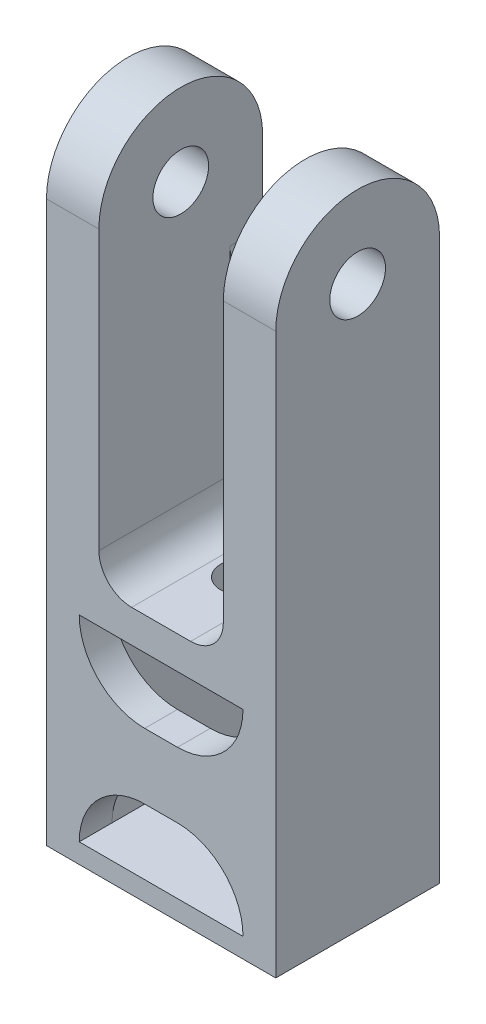
ISO-10303-21;
HEADER;
FILE_DESCRIPTION(('STEP AP214'),'2;1');
FILE_NAME('part.step','',(''),(''),'','','');
FILE_SCHEMA(('AUTOMOTIVE_DESIGN { 1 0 10303 214 1 1 1 1 }'));
ENDSEC;
DATA;
#1=APPLICATION_CONTEXT('core data for automotive mechanical design processes');
#2=APPLICATION_PROTOCOL_DEFINITION('international standard','automotive_design',2000,#1);
#3=PRODUCT_CONTEXT('',#1,'mechanical');
#4=PRODUCT('Part','Part','',(#3));
#5=PRODUCT_RELATED_PRODUCT_CATEGORY('part','',(#4));
#6=PRODUCT_DEFINITION_FORMATION('','',#4);
#7=PRODUCT_DEFINITION_CONTEXT('part definition',#1,'design');
#8=PRODUCT_DEFINITION('design','',#6,#7);
#9=PRODUCT_DEFINITION_SHAPE('','',#8);
#10=(LENGTH_UNIT() NAMED_UNIT(*) SI_UNIT(.MILLI.,.METRE.));
#11=(NAMED_UNIT(*) PLANE_ANGLE_UNIT() SI_UNIT($,.RADIAN.));
#12=(NAMED_UNIT(*) SI_UNIT($,.STERADIAN.) SOLID_ANGLE_UNIT());
#13=UNCERTAINTY_MEASURE_WITH_UNIT(LENGTH_MEASURE(1.E-05),#10,'distance_accuracy_value','');
#14=(GEOMETRIC_REPRESENTATION_CONTEXT(3) GLOBAL_UNCERTAINTY_ASSIGNED_CONTEXT((#13)) GLOBAL_UNIT_ASSIGNED_CONTEXT((#10,
#11,#12)) REPRESENTATION_CONTEXT('',''));
#15=CARTESIAN_POINT('',(0.,0.,0.));
#16=DIRECTION('',(0.,0.,1.));
#17=DIRECTION('',(1.,0.,0.));
#18=AXIS2_PLACEMENT_3D('',#15,#16,#17);
#19=CARTESIAN_POINT('',(0.,0.,20.));
#20=DIRECTION('',(0.,0.,-1.));
#21=DIRECTION('',(-1.,0.,0.));
#22=AXIS2_PLACEMENT_3D('',#19,#20,#21);
#23=PLANE('',#22);
#24=DIRECTION('',(0.,-1.,0.));
#25=VECTOR('',#24,1.);
#26=CARTESIAN_POINT('',(5.00000000000001,5.,20.));
#27=LINE('',#26,#25);
#28=CARTESIAN_POINT('',(5.00000000000001,35.,20.));
#29=VERTEX_POINT('',#28);
#30=CARTESIAN_POINT('',(5.00000000000001,5.,20.));
#31=VERTEX_POINT('',#30);
#32=EDGE_CURVE('E365',#29,#31,#27,.T.);
#33=ORIENTED_EDGE('',*,*,#32,.F.);
#34=CARTESIAN_POINT('',(15.,35.,20.));
#35=DIRECTION('',(0.,0.,-1.));
#36=DIRECTION('',(-1.,0.,0.));
#37=AXIS2_PLACEMENT_3D('',#34,#35,#36);
#38=CIRCLE('',#37,10.);
#39=CARTESIAN_POINT('',(15.,25.,20.));
#40=VERTEX_POINT('',#39);
#41=EDGE_CURVE('E265',#29,#40,#38,.F.);
#42=ORIENTED_EDGE('',*,*,#41,.T.);
#43=DIRECTION('',(1.,0.,0.));
#44=VECTOR('',#43,1.);
#45=CARTESIAN_POINT('',(0.,25.,20.));
#46=LINE('',#45,#44);
#47=CARTESIAN_POINT('',(20.,25.,20.));
#48=VERTEX_POINT('',#47);
#49=EDGE_CURVE('E354',#40,#48,#46,.T.);
#50=ORIENTED_EDGE('',*,*,#49,.T.);
#51=CARTESIAN_POINT('',(20.,35.,20.));
#52=DIRECTION('',(0.,0.,-1.));
#53=DIRECTION('',(-1.,0.,0.));
#54=AXIS2_PLACEMENT_3D('',#51,#52,#53);
#55=CIRCLE('',#54,10.);
#56=CARTESIAN_POINT('',(30.,35.,20.));
#57=VERTEX_POINT('',#56);
#58=EDGE_CURVE('E266',#48,#57,#55,.F.);
#59=ORIENTED_EDGE('',*,*,#58,.T.);
#60=DIRECTION('',(0.,1.,0.));
#61=VECTOR('',#60,1.);
#62=CARTESIAN_POINT('',(30.,5.,20.));
#63=LINE('',#62,#61);
#64=CARTESIAN_POINT('',(30.,5.,20.));
#65=VERTEX_POINT('',#64);
#66=EDGE_CURVE('E363',#65,#57,#63,.T.);
#67=ORIENTED_EDGE('',*,*,#66,.F.);
#68=CARTESIAN_POINT('',(20.,5.,20.));
#69=DIRECTION('',(0.,0.,-1.));
#70=DIRECTION('',(-1.,0.,0.));
#71=AXIS2_PLACEMENT_3D('',#68,#69,#70);
#72=CIRCLE('',#71,10.);
#73=CARTESIAN_POINT('',(20.,15.,20.));
#74=VERTEX_POINT('',#73);
#75=EDGE_CURVE('E508',#65,#74,#72,.F.);
#76=ORIENTED_EDGE('',*,*,#75,.T.);
#77=DIRECTION('',(1.,0.,0.));
#78=VECTOR('',#77,1.);
#79=CARTESIAN_POINT('',(0.,15.,20.));
#80=LINE('',#79,#78);
#81=CARTESIAN_POINT('',(15.,15.,20.));
#82=VERTEX_POINT('',#81);
#83=EDGE_CURVE('E339',#82,#74,#80,.T.);
#84=ORIENTED_EDGE('',*,*,#83,.F.);
#85=CARTESIAN_POINT('',(15.,5.,20.));
#86=DIRECTION('',(0.,0.,-1.));
#87=DIRECTION('',(-1.,0.,0.));
#88=AXIS2_PLACEMENT_3D('',#85,#86,#87);
#89=CIRCLE('',#88,10.);
#90=EDGE_CURVE('E275',#82,#31,#89,.F.);
#91=ORIENTED_EDGE('',*,*,#90,.T.);
#92=EDGE_LOOP('',(#33,#42,#50,#59,#67,#76,#84,#91));
#93=FACE_BOUND('',#92,.T.);
#94=ADVANCED_FACE('F41',(#93),#23,.T.);
#95=CARTESIAN_POINT('',(0.,0.,25.));
#96=DIRECTION('',(0.,0.,-1.));
#97=DIRECTION('',(-1.,0.,0.));
#98=AXIS2_PLACEMENT_3D('',#95,#96,#97);
#99=PLANE('',#98);
#100=DIRECTION('',(0.,-1.,0.));
#101=VECTOR('',#100,1.);
#102=CARTESIAN_POINT('',(0.,0.,25.));
#103=LINE('',#102,#101);
#104=CARTESIAN_POINT('',(0.,87.5,25.));
#105=VERTEX_POINT('',#104);
#106=CARTESIAN_POINT('',(0.,2.00000000000003,25.));
#107=VERTEX_POINT('',#106);
#108=EDGE_CURVE('E419',#105,#107,#103,.T.);
#109=ORIENTED_EDGE('',*,*,#108,.T.);
#110=DIRECTION('',(1.,0.,0.));
#111=VECTOR('',#110,1.);
#112=CARTESIAN_POINT('',(0.,2.00000000000003,25.));
#113=LINE('',#112,#111);
#114=CARTESIAN_POINT('',(35.,2.00000000000003,25.));
#115=VERTEX_POINT('',#114);
#116=EDGE_CURVE('E469',#107,#115,#113,.T.);
#117=ORIENTED_EDGE('',*,*,#116,.T.);
#118=DIRECTION('',(0.,1.,0.));
#119=VECTOR('',#118,1.);
#120=CARTESIAN_POINT('',(35.,0.,25.));
#121=LINE('',#120,#119);
#122=CARTESIAN_POINT('',(35.,87.5,25.));
#123=VERTEX_POINT('',#122);
#124=EDGE_CURVE('E422',#115,#123,#121,.T.);
#125=ORIENTED_EDGE('',*,*,#124,.T.);
#126=DIRECTION('',(-1.,0.,0.));
#127=VECTOR('',#126,1.);
#128=CARTESIAN_POINT('',(0.,87.5,25.));
#129=LINE('',#128,#127);
#130=CARTESIAN_POINT('',(27.,87.5,25.));
#131=VERTEX_POINT('',#130);
#132=EDGE_CURVE('E333',#123,#131,#129,.T.);
#133=ORIENTED_EDGE('',*,*,#132,.T.);
#134=DIRECTION('',(0.,1.,0.));
#135=VECTOR('',#134,1.);
#136=CARTESIAN_POINT('',(27.,160.,25.));
#137=LINE('',#136,#135);
#138=CARTESIAN_POINT('',(27.,45.,25.));
#139=VERTEX_POINT('',#138);
#140=EDGE_CURVE('E412',#139,#131,#137,.T.);
#141=ORIENTED_EDGE('',*,*,#140,.F.);
#142=CARTESIAN_POINT('',(22.,45.,25.));
#143=DIRECTION('',(0.,0.,-1.));
#144=DIRECTION('',(-1.,0.,0.));
#145=AXIS2_PLACEMENT_3D('',#142,#143,#144);
#146=CIRCLE('',#145,5.);
#147=CARTESIAN_POINT('',(22.,40.,25.));
#148=VERTEX_POINT('',#147);
#149=EDGE_CURVE('E496',#139,#148,#146,.T.);
#150=ORIENTED_EDGE('',*,*,#149,.T.);
#151=DIRECTION('',(1.,0.,0.));
#152=VECTOR('',#151,1.);
#153=CARTESIAN_POINT('',(8.00000000000001,40.,25.));
#154=LINE('',#153,#152);
#155=CARTESIAN_POINT('',(13.,40.,25.));
#156=VERTEX_POINT('',#155);
#157=EDGE_CURVE('E416',#156,#148,#154,.T.);
#158=ORIENTED_EDGE('',*,*,#157,.F.);
#159=CARTESIAN_POINT('',(13.,45.,25.));
#160=DIRECTION('',(0.,0.,-1.));
#161=DIRECTION('',(-1.,0.,0.));
#162=AXIS2_PLACEMENT_3D('',#159,#160,#161);
#163=CIRCLE('',#162,5.);
#164=CARTESIAN_POINT('',(8.00000000000001,45.,25.));
#165=VERTEX_POINT('',#164);
#166=EDGE_CURVE('E492',#156,#165,#163,.T.);
#167=ORIENTED_EDGE('',*,*,#166,.T.);
#168=DIRECTION('',(0.,-1.,0.));
#169=VECTOR('',#168,1.);
#170=CARTESIAN_POINT('',(8.00000000000001,160.,25.));
#171=LINE('',#170,#169);
#172=CARTESIAN_POINT('',(8.00000000000001,87.5,25.));
#173=VERTEX_POINT('',#172);
#174=EDGE_CURVE('E414',#173,#165,#171,.T.);
#175=ORIENTED_EDGE('',*,*,#174,.F.);
#176=DIRECTION('',(-1.,0.,0.));
#177=VECTOR('',#176,1.);
#178=CARTESIAN_POINT('',(0.,87.5,25.));
#179=LINE('',#178,#177);
#180=EDGE_CURVE('E439',#173,#105,#179,.T.);
#181=ORIENTED_EDGE('',*,*,#180,.T.);
#182=EDGE_LOOP('',(#109,#117,#125,#133,#141,#150,#158,#167,#175,#181));
#183=FACE_BOUND('',#182,.T.);
#184=DIRECTION('',(-1.,0.,0.));
#185=VECTOR('',#184,1.);
#186=CARTESIAN_POINT('',(0.,5.,25.));
#187=LINE('',#186,#185);
#188=CARTESIAN_POINT('',(30.,5.,25.));
#189=VERTEX_POINT('',#188);
#190=CARTESIAN_POINT('',(5.00000000000001,5.,25.));
#191=VERTEX_POINT('',#190);
#192=EDGE_CURVE('E358',#189,#191,#187,.T.);
#193=ORIENTED_EDGE('',*,*,#192,.T.);
#194=CARTESIAN_POINT('',(15.,5.,25.));
#195=DIRECTION('',(0.,0.,-1.));
#196=DIRECTION('',(-1.,0.,0.));
#197=AXIS2_PLACEMENT_3D('',#194,#195,#196);
#198=CIRCLE('',#197,10.);
#199=CARTESIAN_POINT('',(15.,15.,25.));
#200=VERTEX_POINT('',#199);
#201=EDGE_CURVE('E278',#191,#200,#198,.T.);
#202=ORIENTED_EDGE('',*,*,#201,.T.);
#203=DIRECTION('',(1.,0.,0.));
#204=VECTOR('',#203,1.);
#205=CARTESIAN_POINT('',(0.,15.,25.));
#206=LINE('',#205,#204);
#207=CARTESIAN_POINT('',(20.,15.,25.));
#208=VERTEX_POINT('',#207);
#209=EDGE_CURVE('E343',#200,#208,#206,.T.);
#210=ORIENTED_EDGE('',*,*,#209,.T.);
#211=CARTESIAN_POINT('',(20.,5.,25.));
#212=DIRECTION('',(0.,0.,-1.));
#213=DIRECTION('',(-1.,0.,0.));
#214=AXIS2_PLACEMENT_3D('',#211,#212,#213);
#215=CIRCLE('',#214,10.);
#216=EDGE_CURVE('E270',#208,#189,#215,.T.);
#217=ORIENTED_EDGE('',*,*,#216,.T.);
#218=EDGE_LOOP('',(#193,#202,#210,#217));
#219=FACE_BOUND('',#218,.T.);
#220=DIRECTION('',(1.,0.,0.));
#221=VECTOR('',#220,1.);
#222=CARTESIAN_POINT('',(0.,25.,25.));
#223=LINE('',#222,#221);
#224=CARTESIAN_POINT('',(15.,25.,25.));
#225=VERTEX_POINT('',#224);
#226=CARTESIAN_POINT('',(20.,25.,25.));
#227=VERTEX_POINT('',#226);
#228=EDGE_CURVE('E259',#225,#227,#223,.T.);
#229=ORIENTED_EDGE('',*,*,#228,.F.);
#230=CARTESIAN_POINT('',(15.,35.,25.));
#231=DIRECTION('',(0.,0.,-1.));
#232=DIRECTION('',(-1.,0.,0.));
#233=AXIS2_PLACEMENT_3D('',#230,#231,#232);
#234=CIRCLE('',#233,10.);
#235=CARTESIAN_POINT('',(5.00000000000001,35.,25.));
#236=VERTEX_POINT('',#235);
#237=EDGE_CURVE('E257',#225,#236,#234,.T.);
#238=ORIENTED_EDGE('',*,*,#237,.T.);
#239=DIRECTION('',(1.,0.,0.));
#240=VECTOR('',#239,1.);
#241=CARTESIAN_POINT('',(0.,35.,25.));
#242=LINE('',#241,#240);
#243=CARTESIAN_POINT('',(30.,35.,25.));
#244=VERTEX_POINT('',#243);
#245=EDGE_CURVE('E243',#236,#244,#242,.T.);
#246=ORIENTED_EDGE('',*,*,#245,.T.);
#247=CARTESIAN_POINT('',(20.,35.,25.));
#248=DIRECTION('',(0.,0.,-1.));
#249=DIRECTION('',(-1.,0.,0.));
#250=AXIS2_PLACEMENT_3D('',#247,#248,#249);
#251=CIRCLE('',#250,10.);
#252=EDGE_CURVE('E254',#244,#227,#251,.T.);
#253=ORIENTED_EDGE('',*,*,#252,.T.);
#254=EDGE_LOOP('',(#229,#238,#246,#253));
#255=FACE_BOUND('',#254,.T.);
#256=ADVANCED_FACE('F253',(#183,#219,#255),#99,.F.);
#257=CARTESIAN_POINT('',(17.5,70.,12.5));
#258=DIRECTION('',(0.,-1.,0.));
#259=DIRECTION('',(0.,0.,-1.));
#260=AXIS2_PLACEMENT_3D('',#257,#258,#259);
#261=CYLINDRICAL_SURFACE('',#260,3.4);
#262=CARTESIAN_POINT('',(17.5,5.,12.5));
#263=DIRECTION('',(0.,-1.,0.));
#264=DIRECTION('',(0.,0.,-1.));
#265=AXIS2_PLACEMENT_3D('',#262,#263,#264);
#266=CIRCLE('',#265,3.4);
#267=CARTESIAN_POINT('',(17.5,5.,9.1));
#268=VERTEX_POINT('',#267);
#269=EDGE_CURVE('E394',#268,#268,#266,.F.);
#270=ORIENTED_EDGE('',*,*,#269,.T.);
#271=EDGE_LOOP('',(#270));
#272=FACE_BOUND('',#271,.T.);
#273=CARTESIAN_POINT('',(17.5,0.,12.5));
#274=DIRECTION('',(0.,-1.,0.));
#275=DIRECTION('',(0.,0.,-1.));
#276=AXIS2_PLACEMENT_3D('',#273,#274,#275);
#277=CIRCLE('',#276,3.4);
#278=CARTESIAN_POINT('',(17.5,0.,9.1));
#279=VERTEX_POINT('',#278);
#280=EDGE_CURVE('E401',#279,#279,#277,.T.);
#281=ORIENTED_EDGE('',*,*,#280,.T.);
#282=EDGE_LOOP('',(#281));
#283=FACE_BOUND('',#282,.T.);
#284=ADVANCED_FACE('F560',(#272,#283),#261,.F.);
#285=CARTESIAN_POINT('',(8.00000000000001,87.5,12.5));
#286=DIRECTION('',(-1.,0.,0.));
#287=DIRECTION('',(0.,0.,1.));
#288=AXIS2_PLACEMENT_3D('',#285,#286,#287);
#289=CYLINDRICAL_SURFACE('',#288,12.5);
#290=ORIENTED_EDGE('',*,*,#180,.F.);
#291=CARTESIAN_POINT('',(8.00000000000001,87.5,12.5));
#292=DIRECTION('',(-1.,0.,0.));
#293=DIRECTION('',(0.,0.,1.));
#294=AXIS2_PLACEMENT_3D('',#291,#292,#293);
#295=CIRCLE('',#294,12.5);
#296=CARTESIAN_POINT('',(8.00000000000001,87.5,0.));
#297=VERTEX_POINT('',#296);
#298=EDGE_CURVE('E445',#297,#173,#295,.F.);
#299=ORIENTED_EDGE('',*,*,#298,.F.);
#300=DIRECTION('',(1.,0.,0.));
#301=VECTOR('',#300,1.);
#302=CARTESIAN_POINT('',(8.00000000000001,87.5,0.));
#303=LINE('',#302,#301);
#304=CARTESIAN_POINT('',(0.,87.5,0.));
#305=VERTEX_POINT('',#304);
#306=EDGE_CURVE('E442',#305,#297,#303,.T.);
#307=ORIENTED_EDGE('',*,*,#306,.F.);
#308=CARTESIAN_POINT('',(0.,87.5,12.5));
#309=DIRECTION('',(1.,0.,0.));
#310=DIRECTION('',(0.,0.,-1.));
#311=AXIS2_PLACEMENT_3D('',#308,#309,#310);
#312=CIRCLE('',#311,12.5);
#313=EDGE_CURVE('E447',#105,#305,#312,.F.);
#314=ORIENTED_EDGE('',*,*,#313,.F.);
#315=EDGE_LOOP('',(#290,#299,#307,#314));
#316=FACE_BOUND('',#315,.T.);
#317=ADVANCED_FACE('F613',(#316),#289,.T.);
#318=CARTESIAN_POINT('',(35.,87.5,12.5));
#319=DIRECTION('',(-1.,0.,0.));
#320=DIRECTION('',(0.,0.,1.));
#321=AXIS2_PLACEMENT_3D('',#318,#319,#320);
#322=CYLINDRICAL_SURFACE('',#321,12.5);
#323=ORIENTED_EDGE('',*,*,#132,.F.);
#324=CARTESIAN_POINT('',(35.,87.5,12.5));
#325=DIRECTION('',(-1.,0.,0.));
#326=DIRECTION('',(0.,0.,1.));
#327=AXIS2_PLACEMENT_3D('',#324,#325,#326);
#328=CIRCLE('',#327,12.5);
#329=CARTESIAN_POINT('',(35.,87.5,0.));
#330=VERTEX_POINT('',#329);
#331=EDGE_CURVE('E433',#330,#123,#328,.F.);
#332=ORIENTED_EDGE('',*,*,#331,.F.);
#333=DIRECTION('',(1.,0.,0.));
#334=VECTOR('',#333,1.);
#335=CARTESIAN_POINT('',(35.,87.5,0.));
#336=LINE('',#335,#334);
#337=CARTESIAN_POINT('',(27.,87.5,0.));
#338=VERTEX_POINT('',#337);
#339=EDGE_CURVE('E430',#338,#330,#336,.T.);
#340=ORIENTED_EDGE('',*,*,#339,.F.);
#341=CARTESIAN_POINT('',(27.,87.5,12.5));
#342=DIRECTION('',(1.,0.,0.));
#343=DIRECTION('',(0.,0.,-1.));
#344=AXIS2_PLACEMENT_3D('',#341,#342,#343);
#345=CIRCLE('',#344,12.5);
#346=EDGE_CURVE('E436',#131,#338,#345,.F.);
#347=ORIENTED_EDGE('',*,*,#346,.F.);
#348=EDGE_LOOP('',(#323,#332,#340,#347));
#349=FACE_BOUND('',#348,.T.);
#350=ADVANCED_FACE('F605',(#349),#322,.T.);
#351=CARTESIAN_POINT('',(0.,0.,25.));
#352=DIRECTION('',(1.,0.,0.));
#353=DIRECTION('',(0.,0.,-1.));
#354=AXIS2_PLACEMENT_3D('',#351,#352,#353);
#355=PLANE('',#354);
#356=CARTESIAN_POINT('',(0.,87.5,12.5));
#357=DIRECTION('',(1.,0.,0.));
#358=DIRECTION('',(0.,0.,-1.));
#359=AXIS2_PLACEMENT_3D('',#356,#357,#358);
#360=CIRCLE('',#359,4.25);
#361=CARTESIAN_POINT('',(0.,87.5,8.25));
#362=VERTEX_POINT('',#361);
#363=EDGE_CURVE('E398',#362,#362,#360,.T.);
#364=ORIENTED_EDGE('',*,*,#363,.T.);
#365=EDGE_LOOP('',(#364));
#366=FACE_BOUND('',#365,.T.);
#367=DIRECTION('',(0.,-1.,0.));
#368=VECTOR('',#367,1.);
#369=CARTESIAN_POINT('',(0.,0.,0.));
#370=LINE('',#369,#368);
#371=CARTESIAN_POINT('',(0.,2.00000000000003,0.));
#372=VERTEX_POINT('',#371);
#373=EDGE_CURVE('E411',#305,#372,#370,.T.);
#374=ORIENTED_EDGE('',*,*,#373,.T.);
#375=DIRECTION('',(0.,0.,1.));
#376=VECTOR('',#375,1.);
#377=CARTESIAN_POINT('',(0.,2.00000000000003,25.));
#378=LINE('',#377,#376);
#379=EDGE_CURVE('E471',#372,#107,#378,.T.);
#380=ORIENTED_EDGE('',*,*,#379,.T.);
#381=ORIENTED_EDGE('',*,*,#108,.F.);
#382=ORIENTED_EDGE('',*,*,#313,.T.);
#383=EDGE_LOOP('',(#374,#380,#381,#382));
#384=FACE_BOUND('',#383,.T.);
#385=ADVANCED_FACE('F601',(#366,#384),#355,.F.);
#386=CARTESIAN_POINT('',(0.,0.,25.));
#387=DIRECTION('',(0.,1.,0.));
#388=DIRECTION('',(0.,0.,1.));
#389=AXIS2_PLACEMENT_3D('',#386,#387,#388);
#390=PLANE('',#389);
#391=DIRECTION('',(1.,0.,0.));
#392=VECTOR('',#391,1.);
#393=CARTESIAN_POINT('',(35.,0.,2.00000000000002));
#394=LINE('',#393,#392);
#395=CARTESIAN_POINT('',(2.00000000000002,0.,2.00000000000002));
#396=VERTEX_POINT('',#395);
#397=CARTESIAN_POINT('',(33.,0.,2.00000000000002));
#398=VERTEX_POINT('',#397);
#399=EDGE_CURVE('E460',#396,#398,#394,.T.);
#400=ORIENTED_EDGE('',*,*,#399,.T.);
#401=DIRECTION('',(0.,0.,1.));
#402=VECTOR('',#401,1.);
#403=CARTESIAN_POINT('',(33.,0.,25.));
#404=LINE('',#403,#402);
#405=CARTESIAN_POINT('',(33.,0.,23.));
#406=VERTEX_POINT('',#405);
#407=EDGE_CURVE('E466',#398,#406,#404,.T.);
#408=ORIENTED_EDGE('',*,*,#407,.T.);
#409=DIRECTION('',(-1.,0.,0.));
#410=VECTOR('',#409,1.);
#411=CARTESIAN_POINT('',(0.,0.,23.));
#412=LINE('',#411,#410);
#413=CARTESIAN_POINT('',(2.00000000000002,0.,23.));
#414=VERTEX_POINT('',#413);
#415=EDGE_CURVE('E464',#406,#414,#412,.T.);
#416=ORIENTED_EDGE('',*,*,#415,.T.);
#417=DIRECTION('',(0.,0.,-1.));
#418=VECTOR('',#417,1.);
#419=CARTESIAN_POINT('',(2.00000000000002,0.,25.));
#420=LINE('',#419,#418);
#421=EDGE_CURVE('E462',#414,#396,#420,.T.);
#422=ORIENTED_EDGE('',*,*,#421,.T.);
#423=EDGE_LOOP('',(#400,#408,#416,#422));
#424=FACE_BOUND('',#423,.T.);
#425=ORIENTED_EDGE('',*,*,#280,.F.);
#426=EDGE_LOOP('',(#425));
#427=FACE_BOUND('',#426,.T.);
#428=ADVANCED_FACE('F597',(#424,#427),#390,.F.);
#429=CARTESIAN_POINT('',(35.,0.,25.));
#430=DIRECTION('',(-1.,0.,0.));
#431=DIRECTION('',(0.,0.,1.));
#432=AXIS2_PLACEMENT_3D('',#429,#430,#431);
#433=PLANE('',#432);
#434=CARTESIAN_POINT('',(35.,87.5,12.5));
#435=DIRECTION('',(1.,0.,0.));
#436=DIRECTION('',(0.,0.,-1.));
#437=AXIS2_PLACEMENT_3D('',#434,#435,#436);
#438=CIRCLE('',#437,4.25);
#439=CARTESIAN_POINT('',(35.,87.5,8.25));
#440=VERTEX_POINT('',#439);
#441=EDGE_CURVE('E390',#440,#440,#438,.T.);
#442=ORIENTED_EDGE('',*,*,#441,.F.);
#443=EDGE_LOOP('',(#442));
#444=FACE_BOUND('',#443,.T.);
#445=ORIENTED_EDGE('',*,*,#124,.F.);
#446=DIRECTION('',(0.,0.,-1.));
#447=VECTOR('',#446,1.);
#448=CARTESIAN_POINT('',(35.,2.00000000000003,25.));
#449=LINE('',#448,#447);
#450=CARTESIAN_POINT('',(35.,2.00000000000003,0.));
#451=VERTEX_POINT('',#450);
#452=EDGE_CURVE('E449',#115,#451,#449,.T.);
#453=ORIENTED_EDGE('',*,*,#452,.T.);
#454=DIRECTION('',(0.,1.,0.));
#455=VECTOR('',#454,1.);
#456=CARTESIAN_POINT('',(35.,0.,0.));
#457=LINE('',#456,#455);
#458=EDGE_CURVE('E423',#451,#330,#457,.T.);
#459=ORIENTED_EDGE('',*,*,#458,.T.);
#460=ORIENTED_EDGE('',*,*,#331,.T.);
#461=EDGE_LOOP('',(#445,#453,#459,#460));
#462=FACE_BOUND('',#461,.T.);
#463=ADVANCED_FACE('F594',(#444,#462),#433,.F.);
#464=CARTESIAN_POINT('',(0.,0.,0.));
#465=DIRECTION('',(0.,0.,-1.));
#466=DIRECTION('',(-1.,0.,0.));
#467=AXIS2_PLACEMENT_3D('',#464,#465,#466);
#468=PLANE('',#467);
#469=DIRECTION('',(0.,1.,0.));
#470=VECTOR('',#469,1.);
#471=CARTESIAN_POINT('',(27.,160.,0.));
#472=LINE('',#471,#470);
#473=CARTESIAN_POINT('',(27.,45.,0.));
#474=VERTEX_POINT('',#473);
#475=CARTESIAN_POINT('',(27.,57.25,0.));
#476=VERTEX_POINT('',#475);
#477=EDGE_CURVE('E405',#474,#476,#472,.T.);
#478=ORIENTED_EDGE('',*,*,#477,.T.);
#479=CARTESIAN_POINT('',(23.,57.25,0.));
#480=DIRECTION('',(0.,0.,-1.));
#481=DIRECTION('',(-1.,0.,0.));
#482=AXIS2_PLACEMENT_3D('',#479,#480,#481);
#483=CIRCLE('',#482,4.);
#484=CARTESIAN_POINT('',(23.,61.25,0.));
#485=VERTEX_POINT('',#484);
#486=EDGE_CURVE('E310',#476,#485,#483,.F.);
#487=ORIENTED_EDGE('',*,*,#486,.T.);
#488=DIRECTION('',(-1.,0.,0.));
#489=VECTOR('',#488,1.);
#490=CARTESIAN_POINT('',(8.00000000000001,61.25,0.));
#491=LINE('',#490,#489);
#492=CARTESIAN_POINT('',(12.,61.25,0.));
#493=VERTEX_POINT('',#492);
#494=EDGE_CURVE('E323',#485,#493,#491,.T.);
#495=ORIENTED_EDGE('',*,*,#494,.T.);
#496=CARTESIAN_POINT('',(12.,57.25,0.));
#497=DIRECTION('',(0.,0.,-1.));
#498=DIRECTION('',(-1.,0.,0.));
#499=AXIS2_PLACEMENT_3D('',#496,#497,#498);
#500=CIRCLE('',#499,4.);
#501=CARTESIAN_POINT('',(8.00000000000001,57.25,0.));
#502=VERTEX_POINT('',#501);
#503=EDGE_CURVE('E49',#493,#502,#500,.F.);
#504=ORIENTED_EDGE('',*,*,#503,.T.);
#505=DIRECTION('',(0.,1.,0.));
#506=VECTOR('',#505,1.);
#507=CARTESIAN_POINT('',(8.00000000000001,0.,0.));
#508=LINE('',#507,#506);
#509=CARTESIAN_POINT('',(8.00000000000001,45.,0.));
#510=VERTEX_POINT('',#509);
#511=EDGE_CURVE('E321',#510,#502,#508,.T.);
#512=ORIENTED_EDGE('',*,*,#511,.F.);
#513=CARTESIAN_POINT('',(13.,45.,0.));
#514=DIRECTION('',(0.,0.,-1.));
#515=DIRECTION('',(-1.,0.,0.));
#516=AXIS2_PLACEMENT_3D('',#513,#514,#515);
#517=CIRCLE('',#516,5.);
#518=CARTESIAN_POINT('',(13.,40.,0.));
#519=VERTEX_POINT('',#518);
#520=EDGE_CURVE('E494',#510,#519,#517,.F.);
#521=ORIENTED_EDGE('',*,*,#520,.T.);
#522=DIRECTION('',(1.,0.,0.));
#523=VECTOR('',#522,1.);
#524=CARTESIAN_POINT('',(8.00000000000001,40.,0.));
#525=LINE('',#524,#523);
#526=CARTESIAN_POINT('',(22.,40.,0.));
#527=VERTEX_POINT('',#526);
#528=EDGE_CURVE('E407',#519,#527,#525,.T.);
#529=ORIENTED_EDGE('',*,*,#528,.T.);
#530=CARTESIAN_POINT('',(22.,45.,0.));
#531=DIRECTION('',(0.,0.,-1.));
#532=DIRECTION('',(-1.,0.,0.));
#533=AXIS2_PLACEMENT_3D('',#530,#531,#532);
#534=CIRCLE('',#533,5.);
#535=EDGE_CURVE('E498',#527,#474,#534,.F.);
#536=ORIENTED_EDGE('',*,*,#535,.T.);
#537=EDGE_LOOP('',(#478,#487,#495,#504,#512,#521,#529,#536));
#538=FACE_BOUND('',#537,.T.);
#539=DIRECTION('',(0.,1.,0.));
#540=VECTOR('',#539,1.);
#541=CARTESIAN_POINT('',(5.00000000000001,5.,0.));
#542=LINE('',#541,#540);
#543=CARTESIAN_POINT('',(5.00000000000001,5.,0.));
#544=VERTEX_POINT('',#543);
#545=CARTESIAN_POINT('',(5.00000000000001,35.,0.));
#546=VERTEX_POINT('',#545);
#547=EDGE_CURVE('E369',#544,#546,#542,.T.);
#548=ORIENTED_EDGE('',*,*,#547,.F.);
#549=DIRECTION('',(-1.,0.,0.));
#550=VECTOR('',#549,1.);
#551=CARTESIAN_POINT('',(30.,5.,0.));
#552=LINE('',#551,#550);
#553=CARTESIAN_POINT('',(30.,5.,0.));
#554=VERTEX_POINT('',#553);
#555=EDGE_CURVE('E378',#554,#544,#552,.T.);
#556=ORIENTED_EDGE('',*,*,#555,.F.);
#557=DIRECTION('',(0.,-1.,0.));
#558=VECTOR('',#557,1.);
#559=CARTESIAN_POINT('',(30.,5.,0.));
#560=LINE('',#559,#558);
#561=CARTESIAN_POINT('',(30.,35.,0.));
#562=VERTEX_POINT('',#561);
#563=EDGE_CURVE('E375',#562,#554,#560,.T.);
#564=ORIENTED_EDGE('',*,*,#563,.F.);
#565=DIRECTION('',(1.,0.,0.));
#566=VECTOR('',#565,1.);
#567=CARTESIAN_POINT('',(30.,35.,0.));
#568=LINE('',#567,#566);
#569=EDGE_CURVE('E372',#546,#562,#568,.T.);
#570=ORIENTED_EDGE('',*,*,#569,.F.);
#571=EDGE_LOOP('',(#548,#556,#564,#570));
#572=FACE_BOUND('',#571,.T.);
#573=ORIENTED_EDGE('',*,*,#458,.F.);
#574=DIRECTION('',(-1.,0.,0.));
#575=VECTOR('',#574,1.);
#576=CARTESIAN_POINT('',(0.,2.00000000000003,0.));
#577=LINE('',#576,#575);
#578=EDGE_CURVE('E473',#451,#372,#577,.T.);
#579=ORIENTED_EDGE('',*,*,#578,.T.);
#580=ORIENTED_EDGE('',*,*,#373,.F.);
#581=ORIENTED_EDGE('',*,*,#306,.T.);
#582=CARTESIAN_POINT('',(8.00000000000001,75.25,0.));
#583=VERTEX_POINT('',#582);
#584=EDGE_CURVE('E334',#583,#297,#508,.T.);
#585=ORIENTED_EDGE('',*,*,#584,.F.);
#586=CARTESIAN_POINT('',(12.,75.25,0.));
#587=DIRECTION('',(0.,0.,-1.));
#588=DIRECTION('',(-1.,0.,0.));
#589=AXIS2_PLACEMENT_3D('',#586,#587,#588);
#590=CIRCLE('',#589,4.);
#591=CARTESIAN_POINT('',(12.,71.25,0.));
#592=VERTEX_POINT('',#591);
#593=EDGE_CURVE('E301',#583,#592,#590,.F.);
#594=ORIENTED_EDGE('',*,*,#593,.T.);
#595=DIRECTION('',(1.,0.,0.));
#596=VECTOR('',#595,1.);
#597=CARTESIAN_POINT('',(8.00000000000001,71.25,0.));
#598=LINE('',#597,#596);
#599=CARTESIAN_POINT('',(23.,71.25,0.));
#600=VERTEX_POINT('',#599);
#601=EDGE_CURVE('E349',#592,#600,#598,.T.);
#602=ORIENTED_EDGE('',*,*,#601,.T.);
#603=CARTESIAN_POINT('',(23.,75.25,0.));
#604=DIRECTION('',(0.,0.,-1.));
#605=DIRECTION('',(-1.,0.,0.));
#606=AXIS2_PLACEMENT_3D('',#603,#604,#605);
#607=CIRCLE('',#606,4.);
#608=CARTESIAN_POINT('',(27.,75.25,0.));
#609=VERTEX_POINT('',#608);
#610=EDGE_CURVE('E306',#600,#609,#607,.F.);
#611=ORIENTED_EDGE('',*,*,#610,.T.);
#612=EDGE_CURVE('E408',#609,#338,#472,.T.);
#613=ORIENTED_EDGE('',*,*,#612,.T.);
#614=ORIENTED_EDGE('',*,*,#339,.T.);
#615=EDGE_LOOP('',(#573,#579,#580,#581,#585,#594,#602,#611,#613,#614));
#616=FACE_BOUND('',#615,.T.);
#617=ADVANCED_FACE('F319',(#538,#572,#616),#468,.T.);
#618=CARTESIAN_POINT('',(27.,160.,0.));
#619=DIRECTION('',(1.,0.,0.));
#620=DIRECTION('',(0.,0.,-1.));
#621=AXIS2_PLACEMENT_3D('',#618,#619,#620);
#622=PLANE('',#621);
#623=CARTESIAN_POINT('',(27.,87.5,12.5));
#624=DIRECTION('',(1.,0.,0.));
#625=DIRECTION('',(0.,0.,-1.));
#626=AXIS2_PLACEMENT_3D('',#623,#624,#625);
#627=CIRCLE('',#626,4.25);
#628=CARTESIAN_POINT('',(27.,87.5,8.25));
#629=VERTEX_POINT('',#628);
#630=EDGE_CURVE('E395',#629,#629,#627,.T.);
#631=ORIENTED_EDGE('',*,*,#630,.T.);
#632=EDGE_LOOP('',(#631));
#633=FACE_BOUND('',#632,.T.);
#634=ORIENTED_EDGE('',*,*,#612,.F.);
#635=DIRECTION('',(0.,0.,-1.));
#636=VECTOR('',#635,1.);
#637=CARTESIAN_POINT('',(27.,75.25,0.));
#638=LINE('',#637,#636);
#639=CARTESIAN_POINT('',(27.,75.25,5.));
#640=VERTEX_POINT('',#639);
#641=EDGE_CURVE('E294',#609,#640,#638,.F.);
#642=ORIENTED_EDGE('',*,*,#641,.T.);
#643=DIRECTION('',(0.,-1.,0.));
#644=VECTOR('',#643,1.);
#645=CARTESIAN_POINT('',(27.,61.25,5.));
#646=LINE('',#645,#644);
#647=CARTESIAN_POINT('',(27.,57.25,5.));
#648=VERTEX_POINT('',#647);
#649=EDGE_CURVE('E340',#640,#648,#646,.T.);
#650=ORIENTED_EDGE('',*,*,#649,.T.);
#651=DIRECTION('',(0.,0.,-1.));
#652=VECTOR('',#651,1.);
#653=CARTESIAN_POINT('',(27.,57.25,0.));
#654=LINE('',#653,#652);
#655=EDGE_CURVE('E291',#648,#476,#654,.T.);
#656=ORIENTED_EDGE('',*,*,#655,.T.);
#657=ORIENTED_EDGE('',*,*,#477,.F.);
#658=DIRECTION('',(0.,0.,1.));
#659=VECTOR('',#658,1.);
#660=CARTESIAN_POINT('',(27.,45.,25.));
#661=LINE('',#660,#659);
#662=EDGE_CURVE('E489',#474,#139,#661,.T.);
#663=ORIENTED_EDGE('',*,*,#662,.T.);
#664=ORIENTED_EDGE('',*,*,#140,.T.);
#665=ORIENTED_EDGE('',*,*,#346,.T.);
#666=EDGE_LOOP('',(#634,#642,#650,#656,#657,#663,#664,#665));
#667=FACE_BOUND('',#666,.T.);
#668=ADVANCED_FACE('F588',(#633,#667),#622,.F.);
#669=CARTESIAN_POINT('',(8.00000000000001,160.,0.));
#670=DIRECTION('',(-1.,0.,0.));
#671=DIRECTION('',(0.,0.,1.));
#672=AXIS2_PLACEMENT_3D('',#669,#670,#671);
#673=PLANE('',#672);
#674=DIRECTION('',(0.,1.,0.));
#675=VECTOR('',#674,1.);
#676=CARTESIAN_POINT('',(8.00000000000001,71.25,5.));
#677=LINE('',#676,#675);
#678=CARTESIAN_POINT('',(8.00000000000001,57.25,5.));
#679=VERTEX_POINT('',#678);
#680=CARTESIAN_POINT('',(8.00000000000001,75.25,5.));
#681=VERTEX_POINT('',#680);
#682=EDGE_CURVE('E353',#679,#681,#677,.T.);
#683=ORIENTED_EDGE('',*,*,#682,.T.);
#684=DIRECTION('',(0.,0.,-1.));
#685=VECTOR('',#684,1.);
#686=CARTESIAN_POINT('',(8.00000000000001,75.25,0.));
#687=LINE('',#686,#685);
#688=EDGE_CURVE('E283',#681,#583,#687,.T.);
#689=ORIENTED_EDGE('',*,*,#688,.T.);
#690=ORIENTED_EDGE('',*,*,#584,.T.);
#691=ORIENTED_EDGE('',*,*,#298,.T.);
#692=ORIENTED_EDGE('',*,*,#174,.T.);
#693=DIRECTION('',(0.,0.,1.));
#694=VECTOR('',#693,1.);
#695=CARTESIAN_POINT('',(8.00000000000001,45.,0.));
#696=LINE('',#695,#694);
#697=EDGE_CURVE('E332',#165,#510,#696,.F.);
#698=ORIENTED_EDGE('',*,*,#697,.T.);
#699=ORIENTED_EDGE('',*,*,#511,.T.);
#700=DIRECTION('',(0.,0.,-1.));
#701=VECTOR('',#700,1.);
#702=CARTESIAN_POINT('',(8.00000000000001,57.25,0.));
#703=LINE('',#702,#701);
#704=EDGE_CURVE('E280',#502,#679,#703,.F.);
#705=ORIENTED_EDGE('',*,*,#704,.T.);
#706=EDGE_LOOP('',(#683,#689,#690,#691,#692,#698,#699,#705));
#707=FACE_BOUND('',#706,.T.);
#708=CARTESIAN_POINT('',(8.00000000000001,87.5,12.5));
#709=DIRECTION('',(-1.,0.,0.));
#710=DIRECTION('',(0.,0.,1.));
#711=AXIS2_PLACEMENT_3D('',#708,#709,#710);
#712=CIRCLE('',#711,4.25);
#713=CARTESIAN_POINT('',(8.00000000000001,87.5,16.75));
#714=VERTEX_POINT('',#713);
#715=EDGE_CURVE('E393',#714,#714,#712,.T.);
#716=ORIENTED_EDGE('',*,*,#715,.T.);
#717=EDGE_LOOP('',(#716));
#718=FACE_BOUND('',#717,.T.);
#719=ADVANCED_FACE('F328',(#707,#718),#673,.F.);
#720=CARTESIAN_POINT('',(8.00000000000001,40.,0.));
#721=DIRECTION('',(0.,-1.,0.));
#722=DIRECTION('',(0.,0.,-1.));
#723=AXIS2_PLACEMENT_3D('',#720,#721,#722);
#724=PLANE('',#723);
#725=CARTESIAN_POINT('',(17.5,40.,12.5));
#726=DIRECTION('',(0.,-1.,0.));
#727=DIRECTION('',(0.,0.,-1.));
#728=AXIS2_PLACEMENT_3D('',#725,#726,#727);
#729=CIRCLE('',#728,3.4);
#730=CARTESIAN_POINT('',(17.5,40.,9.1));
#731=VERTEX_POINT('',#730);
#732=EDGE_CURVE('E404',#731,#731,#729,.T.);
#733=ORIENTED_EDGE('',*,*,#732,.T.);
#734=EDGE_LOOP('',(#733));
#735=FACE_BOUND('',#734,.T.);
#736=ORIENTED_EDGE('',*,*,#528,.F.);
#737=DIRECTION('',(0.,0.,1.));
#738=VECTOR('',#737,1.);
#739=CARTESIAN_POINT('',(13.,40.,25.));
#740=LINE('',#739,#738);
#741=EDGE_CURVE('E485',#519,#156,#740,.T.);
#742=ORIENTED_EDGE('',*,*,#741,.T.);
#743=ORIENTED_EDGE('',*,*,#157,.T.);
#744=DIRECTION('',(0.,0.,1.));
#745=VECTOR('',#744,1.);
#746=CARTESIAN_POINT('',(22.,40.,0.));
#747=LINE('',#746,#745);
#748=EDGE_CURVE('E475',#148,#527,#747,.F.);
#749=ORIENTED_EDGE('',*,*,#748,.T.);
#750=EDGE_LOOP('',(#736,#742,#743,#749));
#751=FACE_BOUND('',#750,.T.);
#752=ADVANCED_FACE('F581',(#735,#751),#724,.F.);
#753=CARTESIAN_POINT('',(17.5,35.,12.5));
#754=DIRECTION('',(0.,1.,0.));
#755=DIRECTION('',(0.,0.,1.));
#756=AXIS2_PLACEMENT_3D('',#753,#754,#755);
#757=CIRCLE('',#756,3.4);
#758=CARTESIAN_POINT('',(17.5,35.,15.9));
#759=VERTEX_POINT('',#758);
#760=EDGE_CURVE('E368',#759,#759,#757,.F.);
#761=ORIENTED_EDGE('',*,*,#760,.T.);
#762=EDGE_LOOP('',(#761));
#763=FACE_BOUND('',#762,.T.);
#764=ORIENTED_EDGE('',*,*,#732,.F.);
#765=EDGE_LOOP('',(#764));
#766=FACE_BOUND('',#765,.T.);
#767=ADVANCED_FACE('F577',(#763,#766),#261,.F.);
#768=CARTESIAN_POINT('',(-10.,87.5,12.5));
#769=DIRECTION('',(1.,0.,0.));
#770=DIRECTION('',(0.,0.,-1.));
#771=AXIS2_PLACEMENT_3D('',#768,#769,#770);
#772=CYLINDRICAL_SURFACE('',#771,4.25);
#773=ORIENTED_EDGE('',*,*,#715,.F.);
#774=EDGE_LOOP('',(#773));
#775=FACE_BOUND('',#774,.T.);
#776=ORIENTED_EDGE('',*,*,#363,.F.);
#777=EDGE_LOOP('',(#776));
#778=FACE_BOUND('',#777,.T.);
#779=ADVANCED_FACE('F574',(#775,#778),#772,.F.);
#780=ORIENTED_EDGE('',*,*,#441,.T.);
#781=EDGE_LOOP('',(#780));
#782=FACE_BOUND('',#781,.T.);
#783=ORIENTED_EDGE('',*,*,#630,.F.);
#784=EDGE_LOOP('',(#783));
#785=FACE_BOUND('',#784,.T.);
#786=ADVANCED_FACE('F566',(#782,#785),#772,.F.);
#787=CARTESIAN_POINT('',(30.,5.,64.0512483795333));
#788=DIRECTION('',(0.,-1.,0.));
#789=DIRECTION('',(0.,0.,-1.));
#790=AXIS2_PLACEMENT_3D('',#787,#788,#789);
#791=PLANE('',#790);
#792=DIRECTION('',(0.,0.,-1.));
#793=VECTOR('',#792,1.);
#794=CARTESIAN_POINT('',(5.00000000000001,5.,64.0512483795333));
#795=LINE('',#794,#793);
#796=EDGE_CURVE('E366',#191,#31,#795,.T.);
#797=ORIENTED_EDGE('',*,*,#796,.F.);
#798=ORIENTED_EDGE('',*,*,#192,.F.);
#799=DIRECTION('',(0.,0.,-1.));
#800=VECTOR('',#799,1.);
#801=CARTESIAN_POINT('',(30.,5.,64.0512483795333));
#802=LINE('',#801,#800);
#803=EDGE_CURVE('E385',#189,#65,#802,.T.);
#804=ORIENTED_EDGE('',*,*,#803,.T.);
#805=EDGE_CURVE('E249',#65,#554,#802,.T.);
#806=ORIENTED_EDGE('',*,*,#805,.T.);
#807=ORIENTED_EDGE('',*,*,#555,.T.);
#808=EDGE_CURVE('E384',#31,#544,#795,.T.);
#809=ORIENTED_EDGE('',*,*,#808,.F.);
#810=EDGE_LOOP('',(#797,#798,#804,#806,#807,#809));
#811=FACE_BOUND('',#810,.T.);
#812=ORIENTED_EDGE('',*,*,#269,.F.);
#813=EDGE_LOOP('',(#812));
#814=FACE_BOUND('',#813,.T.);
#815=ADVANCED_FACE('F518',(#811,#814),#791,.F.);
#816=CARTESIAN_POINT('',(30.,35.,64.0512483795333));
#817=DIRECTION('',(0.,1.,0.));
#818=DIRECTION('',(0.,0.,1.));
#819=AXIS2_PLACEMENT_3D('',#816,#817,#818);
#820=PLANE('',#819);
#821=DIRECTION('',(0.,0.,-1.));
#822=VECTOR('',#821,1.);
#823=CARTESIAN_POINT('',(30.,35.,64.0512483795333));
#824=LINE('',#823,#822);
#825=EDGE_CURVE('E238',#244,#57,#824,.T.);
#826=ORIENTED_EDGE('',*,*,#825,.F.);
#827=ORIENTED_EDGE('',*,*,#245,.F.);
#828=DIRECTION('',(0.,0.,-1.));
#829=VECTOR('',#828,1.);
#830=CARTESIAN_POINT('',(5.00000000000001,35.,64.0512483795333));
#831=LINE('',#830,#829);
#832=EDGE_CURVE('E388',#236,#29,#831,.T.);
#833=ORIENTED_EDGE('',*,*,#832,.T.);
#834=EDGE_CURVE('E381',#29,#546,#831,.T.);
#835=ORIENTED_EDGE('',*,*,#834,.T.);
#836=ORIENTED_EDGE('',*,*,#569,.T.);
#837=EDGE_CURVE('E246',#57,#562,#824,.T.);
#838=ORIENTED_EDGE('',*,*,#837,.F.);
#839=EDGE_LOOP('',(#826,#827,#833,#835,#836,#838));
#840=FACE_BOUND('',#839,.T.);
#841=ORIENTED_EDGE('',*,*,#760,.F.);
#842=EDGE_LOOP('',(#841));
#843=FACE_BOUND('',#842,.T.);
#844=ADVANCED_FACE('F240',(#840,#843),#820,.F.);
#845=CARTESIAN_POINT('',(5.00000000000001,5.,64.0512483795333));
#846=DIRECTION('',(-1.,0.,0.));
#847=DIRECTION('',(0.,-1.,0.));
#848=AXIS2_PLACEMENT_3D('',#845,#846,#847);
#849=PLANE('',#848);
#850=ORIENTED_EDGE('',*,*,#834,.F.);
#851=ORIENTED_EDGE('',*,*,#32,.T.);
#852=ORIENTED_EDGE('',*,*,#808,.T.);
#853=ORIENTED_EDGE('',*,*,#547,.T.);
#854=EDGE_LOOP('',(#850,#851,#852,#853));
#855=FACE_BOUND('',#854,.T.);
#856=ADVANCED_FACE('F535',(#855),#849,.F.);
#857=CARTESIAN_POINT('',(30.,5.,64.0512483795333));
#858=DIRECTION('',(1.,0.,0.));
#859=DIRECTION('',(0.,0.,-1.));
#860=AXIS2_PLACEMENT_3D('',#857,#858,#859);
#861=PLANE('',#860);
#862=ORIENTED_EDGE('',*,*,#805,.F.);
#863=ORIENTED_EDGE('',*,*,#66,.T.);
#864=ORIENTED_EDGE('',*,*,#837,.T.);
#865=ORIENTED_EDGE('',*,*,#563,.T.);
#866=EDGE_LOOP('',(#862,#863,#864,#865));
#867=FACE_BOUND('',#866,.T.);
#868=ADVANCED_FACE('F527',(#867),#861,.F.);
#869=CARTESIAN_POINT('',(2.00000000000002,0.,25.));
#870=DIRECTION('',(0.70710678118655,0.707106781186545,0.));
#871=DIRECTION('',(0.,0.,-1.));
#872=AXIS2_PLACEMENT_3D('',#869,#870,#871);
#873=PLANE('',#872);
#874=DIRECTION('',(0.577350269189625,-0.577350269189629,0.577350269189625));
#875=VECTOR('',#874,1.);
#876=CARTESIAN_POINT('',(1.33333333333335,0.666666666666673,1.33333333333335));
#877=LINE('',#876,#875);
#878=EDGE_CURVE('E479',#396,#372,#877,.F.);
#879=ORIENTED_EDGE('',*,*,#878,.F.);
#880=ORIENTED_EDGE('',*,*,#421,.F.);
#881=DIRECTION('',(-0.577350269189625,0.577350269189629,0.577350269189625));
#882=VECTOR('',#881,1.);
#883=CARTESIAN_POINT('',(1.33333333333335,0.666666666666673,23.6666666666667));
#884=LINE('',#883,#882);
#885=EDGE_CURVE('E373',#107,#414,#884,.F.);
#886=ORIENTED_EDGE('',*,*,#885,.F.);
#887=ORIENTED_EDGE('',*,*,#379,.F.);
#888=EDGE_LOOP('',(#879,#880,#886,#887));
#889=FACE_BOUND('',#888,.T.);
#890=ADVANCED_FACE('F569',(#889),#873,.F.);
#891=CARTESIAN_POINT('',(0.,2.00000000000003,25.));
#892=DIRECTION('',(0.,0.707106781186545,-0.70710678118655));
#893=DIRECTION('',(1.,0.,0.));
#894=AXIS2_PLACEMENT_3D('',#891,#892,#893);
#895=PLANE('',#894);
#896=ORIENTED_EDGE('',*,*,#885,.T.);
#897=ORIENTED_EDGE('',*,*,#415,.F.);
#898=DIRECTION('',(0.577350269189625,0.577350269189629,0.577350269189625));
#899=VECTOR('',#898,1.);
#900=CARTESIAN_POINT('',(23.3333333333334,-9.66666666666666,13.3333333333334));
#901=LINE('',#900,#899);
#902=EDGE_CURVE('E477',#115,#406,#901,.F.);
#903=ORIENTED_EDGE('',*,*,#902,.F.);
#904=ORIENTED_EDGE('',*,*,#116,.F.);
#905=EDGE_LOOP('',(#896,#897,#903,#904));
#906=FACE_BOUND('',#905,.T.);
#907=ADVANCED_FACE('F635',(#906),#895,.F.);
#908=CARTESIAN_POINT('',(0.,0.,2.00000000000002));
#909=DIRECTION('',(0.,-0.707106781186545,-0.70710678118655));
#910=DIRECTION('',(-1.,0.,0.));
#911=AXIS2_PLACEMENT_3D('',#908,#909,#910);
#912=PLANE('',#911);
#913=ORIENTED_EDGE('',*,*,#878,.T.);
#914=ORIENTED_EDGE('',*,*,#578,.F.);
#915=DIRECTION('',(0.577350269189625,0.577350269189629,-0.577350269189625));
#916=VECTOR('',#915,1.);
#917=CARTESIAN_POINT('',(22.,-11.,13.));
#918=LINE('',#917,#916);
#919=EDGE_CURVE('E258',#398,#451,#918,.T.);
#920=ORIENTED_EDGE('',*,*,#919,.F.);
#921=ORIENTED_EDGE('',*,*,#399,.F.);
#922=EDGE_LOOP('',(#913,#914,#920,#921));
#923=FACE_BOUND('',#922,.T.);
#924=ADVANCED_FACE('F628',(#923),#912,.T.);
#925=CARTESIAN_POINT('',(35.,2.00000000000003,25.));
#926=DIRECTION('',(-0.70710678118655,0.707106781186545,0.));
#927=DIRECTION('',(0.,0.,-1.));
#928=AXIS2_PLACEMENT_3D('',#925,#926,#927);
#929=PLANE('',#928);
#930=ORIENTED_EDGE('',*,*,#902,.T.);
#931=ORIENTED_EDGE('',*,*,#407,.F.);
#932=ORIENTED_EDGE('',*,*,#919,.T.);
#933=ORIENTED_EDGE('',*,*,#452,.F.);
#934=EDGE_LOOP('',(#930,#931,#932,#933));
#935=FACE_BOUND('',#934,.T.);
#936=ADVANCED_FACE('F622',(#935),#929,.F.);
#937=CARTESIAN_POINT('',(13.,45.,0.));
#938=DIRECTION('',(0.,0.,-1.));
#939=DIRECTION('',(-1.,0.,0.));
#940=AXIS2_PLACEMENT_3D('',#937,#938,#939);
#941=CYLINDRICAL_SURFACE('',#940,5.);
#942=ORIENTED_EDGE('',*,*,#520,.F.);
#943=ORIENTED_EDGE('',*,*,#697,.F.);
#944=ORIENTED_EDGE('',*,*,#166,.F.);
#945=ORIENTED_EDGE('',*,*,#741,.F.);
#946=EDGE_LOOP('',(#942,#943,#944,#945));
#947=FACE_BOUND('',#946,.T.);
#948=ADVANCED_FACE('F552',(#947),#941,.F.);
#949=CARTESIAN_POINT('',(22.,45.,0.));
#950=DIRECTION('',(0.,0.,-1.));
#951=DIRECTION('',(-1.,0.,0.));
#952=AXIS2_PLACEMENT_3D('',#949,#950,#951);
#953=CYLINDRICAL_SURFACE('',#952,5.);
#954=ORIENTED_EDGE('',*,*,#535,.F.);
#955=ORIENTED_EDGE('',*,*,#748,.F.);
#956=ORIENTED_EDGE('',*,*,#149,.F.);
#957=ORIENTED_EDGE('',*,*,#662,.F.);
#958=EDGE_LOOP('',(#954,#955,#956,#957));
#959=FACE_BOUND('',#958,.T.);
#960=ADVANCED_FACE('F544',(#959),#953,.F.);
#961=CARTESIAN_POINT('',(0.,15.,25.));
#962=DIRECTION('',(0.,1.,0.));
#963=DIRECTION('',(-1.,0.,0.));
#964=AXIS2_PLACEMENT_3D('',#961,#962,#963);
#965=PLANE('',#964);
#966=ORIENTED_EDGE('',*,*,#83,.T.);
#967=DIRECTION('',(0.,0.,-1.));
#968=VECTOR('',#967,1.);
#969=CARTESIAN_POINT('',(20.,15.,25.));
#970=LINE('',#969,#968);
#971=EDGE_CURVE('E503',#74,#208,#970,.F.);
#972=ORIENTED_EDGE('',*,*,#971,.T.);
#973=ORIENTED_EDGE('',*,*,#209,.F.);
#974=DIRECTION('',(0.,0.,-1.));
#975=VECTOR('',#974,1.);
#976=CARTESIAN_POINT('',(15.,15.,20.));
#977=LINE('',#976,#975);
#978=EDGE_CURVE('E500',#200,#82,#977,.T.);
#979=ORIENTED_EDGE('',*,*,#978,.T.);
#980=EDGE_LOOP('',(#966,#972,#973,#979));
#981=FACE_BOUND('',#980,.T.);
#982=ADVANCED_FACE('F541',(#981),#965,.F.);
#983=CARTESIAN_POINT('',(0.,25.,25.));
#984=DIRECTION('',(0.,1.,0.));
#985=DIRECTION('',(-1.,0.,0.));
#986=AXIS2_PLACEMENT_3D('',#983,#984,#985);
#987=PLANE('',#986);
#988=ORIENTED_EDGE('',*,*,#228,.T.);
#989=DIRECTION('',(0.,0.,-1.));
#990=VECTOR('',#989,1.);
#991=CARTESIAN_POINT('',(20.,25.,25.));
#992=LINE('',#991,#990);
#993=EDGE_CURVE('E264',#227,#48,#992,.T.);
#994=ORIENTED_EDGE('',*,*,#993,.T.);
#995=ORIENTED_EDGE('',*,*,#49,.F.);
#996=DIRECTION('',(0.,0.,-1.));
#997=VECTOR('',#996,1.);
#998=CARTESIAN_POINT('',(15.,25.,25.));
#999=LINE('',#998,#997);
#1000=EDGE_CURVE('E505',#40,#225,#999,.F.);
#1001=ORIENTED_EDGE('',*,*,#1000,.T.);
#1002=EDGE_LOOP('',(#988,#994,#995,#1001));
#1003=FACE_BOUND('',#1002,.T.);
#1004=ADVANCED_FACE('F543',(#1003),#987,.T.);
#1005=CARTESIAN_POINT('',(20.,5.,64.0512483795333));
#1006=DIRECTION('',(0.,0.,1.));
#1007=DIRECTION('',(1.,0.,0.));
#1008=AXIS2_PLACEMENT_3D('',#1005,#1006,#1007);
#1009=CYLINDRICAL_SURFACE('',#1008,10.);
#1010=ORIENTED_EDGE('',*,*,#216,.F.);
#1011=ORIENTED_EDGE('',*,*,#971,.F.);
#1012=ORIENTED_EDGE('',*,*,#75,.F.);
#1013=ORIENTED_EDGE('',*,*,#803,.F.);
#1014=EDGE_LOOP('',(#1010,#1011,#1012,#1013));
#1015=FACE_BOUND('',#1014,.T.);
#1016=ADVANCED_FACE('F522',(#1015),#1009,.F.);
#1017=CARTESIAN_POINT('',(20.,35.,25.));
#1018=DIRECTION('',(0.,0.,-1.));
#1019=DIRECTION('',(-1.,0.,0.));
#1020=AXIS2_PLACEMENT_3D('',#1017,#1018,#1019);
#1021=CYLINDRICAL_SURFACE('',#1020,10.);
#1022=ORIENTED_EDGE('',*,*,#252,.F.);
#1023=ORIENTED_EDGE('',*,*,#825,.T.);
#1024=ORIENTED_EDGE('',*,*,#58,.F.);
#1025=ORIENTED_EDGE('',*,*,#993,.F.);
#1026=EDGE_LOOP('',(#1022,#1023,#1024,#1025));
#1027=FACE_BOUND('',#1026,.T.);
#1028=ADVANCED_FACE('F262',(#1027),#1021,.F.);
#1029=CARTESIAN_POINT('',(15.,35.,64.0512483795333));
#1030=DIRECTION('',(0.,0.,-1.));
#1031=DIRECTION('',(-1.,0.,0.));
#1032=AXIS2_PLACEMENT_3D('',#1029,#1030,#1031);
#1033=CYLINDRICAL_SURFACE('',#1032,10.);
#1034=ORIENTED_EDGE('',*,*,#237,.F.);
#1035=ORIENTED_EDGE('',*,*,#1000,.F.);
#1036=ORIENTED_EDGE('',*,*,#41,.F.);
#1037=ORIENTED_EDGE('',*,*,#832,.F.);
#1038=EDGE_LOOP('',(#1034,#1035,#1036,#1037));
#1039=FACE_BOUND('',#1038,.T.);
#1040=ADVANCED_FACE('F654',(#1039),#1033,.F.);
#1041=CARTESIAN_POINT('',(15.,5.,25.));
#1042=DIRECTION('',(0.,0.,1.));
#1043=DIRECTION('',(1.,0.,0.));
#1044=AXIS2_PLACEMENT_3D('',#1041,#1042,#1043);
#1045=CYLINDRICAL_SURFACE('',#1044,10.);
#1046=ORIENTED_EDGE('',*,*,#201,.F.);
#1047=ORIENTED_EDGE('',*,*,#796,.T.);
#1048=ORIENTED_EDGE('',*,*,#90,.F.);
#1049=ORIENTED_EDGE('',*,*,#978,.F.);
#1050=EDGE_LOOP('',(#1046,#1047,#1048,#1049));
#1051=FACE_BOUND('',#1050,.T.);
#1052=ADVANCED_FACE('F539',(#1051),#1045,.F.);
#1053=CARTESIAN_POINT('',(8.00000000000001,61.25,5.));
#1054=DIRECTION('',(0.,-1.,0.));
#1055=DIRECTION('',(0.,0.,-1.));
#1056=AXIS2_PLACEMENT_3D('',#1053,#1054,#1055);
#1057=PLANE('',#1056);
#1058=ORIENTED_EDGE('',*,*,#494,.F.);
#1059=DIRECTION('',(0.,0.,-1.));
#1060=VECTOR('',#1059,1.);
#1061=CARTESIAN_POINT('',(23.,61.25,5.));
#1062=LINE('',#1061,#1060);
#1063=CARTESIAN_POINT('',(23.,61.25,5.));
#1064=VERTEX_POINT('',#1063);
#1065=EDGE_CURVE('E61',#485,#1064,#1062,.F.);
#1066=ORIENTED_EDGE('',*,*,#1065,.T.);
#1067=DIRECTION('',(-1.,0.,0.));
#1068=VECTOR('',#1067,1.);
#1069=CARTESIAN_POINT('',(8.00000000000001,61.25,5.));
#1070=LINE('',#1069,#1068);
#1071=CARTESIAN_POINT('',(12.,61.25,5.));
#1072=VERTEX_POINT('',#1071);
#1073=EDGE_CURVE('E337',#1064,#1072,#1070,.T.);
#1074=ORIENTED_EDGE('',*,*,#1073,.T.);
#1075=DIRECTION('',(0.,0.,-1.));
#1076=VECTOR('',#1075,1.);
#1077=CARTESIAN_POINT('',(12.,61.25,5.));
#1078=LINE('',#1077,#1076);
#1079=EDGE_CURVE('E297',#1072,#493,#1078,.T.);
#1080=ORIENTED_EDGE('',*,*,#1079,.T.);
#1081=EDGE_LOOP('',(#1058,#1066,#1074,#1080));
#1082=FACE_BOUND('',#1081,.T.);
#1083=ADVANCED_FACE('F336',(#1082),#1057,.T.);
#1084=CARTESIAN_POINT('',(8.00000000000001,71.25,5.));
#1085=DIRECTION('',(0.,1.,0.));
#1086=DIRECTION('',(0.,0.,1.));
#1087=AXIS2_PLACEMENT_3D('',#1084,#1085,#1086);
#1088=PLANE('',#1087);
#1089=ORIENTED_EDGE('',*,*,#601,.F.);
#1090=DIRECTION('',(0.,0.,-1.));
#1091=VECTOR('',#1090,1.);
#1092=CARTESIAN_POINT('',(12.,71.25,5.));
#1093=LINE('',#1092,#1091);
#1094=CARTESIAN_POINT('',(12.,71.25,5.));
#1095=VERTEX_POINT('',#1094);
#1096=EDGE_CURVE('E289',#592,#1095,#1093,.F.);
#1097=ORIENTED_EDGE('',*,*,#1096,.T.);
#1098=DIRECTION('',(1.,0.,0.));
#1099=VECTOR('',#1098,1.);
#1100=CARTESIAN_POINT('',(8.00000000000001,71.25,5.));
#1101=LINE('',#1100,#1099);
#1102=CARTESIAN_POINT('',(23.,71.25,5.));
#1103=VERTEX_POINT('',#1102);
#1104=EDGE_CURVE('E345',#1095,#1103,#1101,.T.);
#1105=ORIENTED_EDGE('',*,*,#1104,.T.);
#1106=DIRECTION('',(0.,0.,-1.));
#1107=VECTOR('',#1106,1.);
#1108=CARTESIAN_POINT('',(23.,71.25,5.));
#1109=LINE('',#1108,#1107);
#1110=EDGE_CURVE('E286',#1103,#600,#1109,.T.);
#1111=ORIENTED_EDGE('',*,*,#1110,.T.);
#1112=EDGE_LOOP('',(#1089,#1097,#1105,#1111));
#1113=FACE_BOUND('',#1112,.T.);
#1114=ADVANCED_FACE('F684',(#1113),#1088,.T.);
#1115=CARTESIAN_POINT('',(0.,0.,5.));
#1116=DIRECTION('',(0.,0.,1.));
#1117=DIRECTION('',(1.,0.,0.));
#1118=AXIS2_PLACEMENT_3D('',#1115,#1116,#1117);
#1119=PLANE('',#1118);
#1120=ORIENTED_EDGE('',*,*,#682,.F.);
#1121=CARTESIAN_POINT('',(12.,57.25,5.));
#1122=DIRECTION('',(0.,0.,1.));
#1123=DIRECTION('',(1.,0.,0.));
#1124=AXIS2_PLACEMENT_3D('',#1121,#1122,#1123);
#1125=CIRCLE('',#1124,4.);
#1126=EDGE_CURVE('E12',#679,#1072,#1125,.F.);
#1127=ORIENTED_EDGE('',*,*,#1126,.T.);
#1128=ORIENTED_EDGE('',*,*,#1073,.F.);
#1129=CARTESIAN_POINT('',(23.,57.25,5.));
#1130=DIRECTION('',(0.,0.,1.));
#1131=DIRECTION('',(1.,0.,0.));
#1132=AXIS2_PLACEMENT_3D('',#1129,#1130,#1131);
#1133=CIRCLE('',#1132,4.);
#1134=EDGE_CURVE('E312',#1064,#648,#1133,.F.);
#1135=ORIENTED_EDGE('',*,*,#1134,.T.);
#1136=ORIENTED_EDGE('',*,*,#649,.F.);
#1137=CARTESIAN_POINT('',(23.,75.25,5.));
#1138=DIRECTION('',(0.,0.,1.));
#1139=DIRECTION('',(1.,0.,0.));
#1140=AXIS2_PLACEMENT_3D('',#1137,#1138,#1139);
#1141=CIRCLE('',#1140,4.);
#1142=EDGE_CURVE('E308',#640,#1103,#1141,.F.);
#1143=ORIENTED_EDGE('',*,*,#1142,.T.);
#1144=ORIENTED_EDGE('',*,*,#1104,.F.);
#1145=CARTESIAN_POINT('',(12.,75.25,5.));
#1146=DIRECTION('',(0.,0.,1.));
#1147=DIRECTION('',(1.,0.,0.));
#1148=AXIS2_PLACEMENT_3D('',#1145,#1146,#1147);
#1149=CIRCLE('',#1148,4.);
#1150=EDGE_CURVE('E303',#1095,#681,#1149,.F.);
#1151=ORIENTED_EDGE('',*,*,#1150,.T.);
#1152=EDGE_LOOP('',(#1120,#1127,#1128,#1135,#1136,#1143,#1144,#1151));
#1153=FACE_BOUND('',#1152,.T.);
#1154=ADVANCED_FACE('F664',(#1153),#1119,.T.);
#1155=CARTESIAN_POINT('',(12.,75.25,0.));
#1156=DIRECTION('',(0.,0.,-1.));
#1157=DIRECTION('',(-1.,0.,0.));
#1158=AXIS2_PLACEMENT_3D('',#1155,#1156,#1157);
#1159=CYLINDRICAL_SURFACE('',#1158,4.);
#1160=ORIENTED_EDGE('',*,*,#1150,.F.);
#1161=ORIENTED_EDGE('',*,*,#1096,.F.);
#1162=ORIENTED_EDGE('',*,*,#593,.F.);
#1163=ORIENTED_EDGE('',*,*,#688,.F.);
#1164=EDGE_LOOP('',(#1160,#1161,#1162,#1163));
#1165=FACE_BOUND('',#1164,.T.);
#1166=ADVANCED_FACE('F660',(#1165),#1159,.F.);
#1167=CARTESIAN_POINT('',(23.,75.25,5.));
#1168=DIRECTION('',(0.,0.,-1.));
#1169=DIRECTION('',(-1.,0.,0.));
#1170=AXIS2_PLACEMENT_3D('',#1167,#1168,#1169);
#1171=CYLINDRICAL_SURFACE('',#1170,4.);
#1172=ORIENTED_EDGE('',*,*,#1142,.F.);
#1173=ORIENTED_EDGE('',*,*,#641,.F.);
#1174=ORIENTED_EDGE('',*,*,#610,.F.);
#1175=ORIENTED_EDGE('',*,*,#1110,.F.);
#1176=EDGE_LOOP('',(#1172,#1173,#1174,#1175));
#1177=FACE_BOUND('',#1176,.T.);
#1178=ADVANCED_FACE('F663',(#1177),#1171,.F.);
#1179=CARTESIAN_POINT('',(23.,57.25,0.));
#1180=DIRECTION('',(0.,0.,-1.));
#1181=DIRECTION('',(-1.,0.,0.));
#1182=AXIS2_PLACEMENT_3D('',#1179,#1180,#1181);
#1183=CYLINDRICAL_SURFACE('',#1182,4.);
#1184=ORIENTED_EDGE('',*,*,#1134,.F.);
#1185=ORIENTED_EDGE('',*,*,#1065,.F.);
#1186=ORIENTED_EDGE('',*,*,#486,.F.);
#1187=ORIENTED_EDGE('',*,*,#655,.F.);
#1188=EDGE_LOOP('',(#1184,#1185,#1186,#1187));
#1189=FACE_BOUND('',#1188,.T.);
#1190=ADVANCED_FACE('F667',(#1189),#1183,.F.);
#1191=CARTESIAN_POINT('',(12.,57.25,5.));
#1192=DIRECTION('',(0.,0.,-1.));
#1193=DIRECTION('',(-1.,0.,0.));
#1194=AXIS2_PLACEMENT_3D('',#1191,#1192,#1193);
#1195=CYLINDRICAL_SURFACE('',#1194,4.);
#1196=ORIENTED_EDGE('',*,*,#1126,.F.);
#1197=ORIENTED_EDGE('',*,*,#704,.F.);
#1198=ORIENTED_EDGE('',*,*,#503,.F.);
#1199=ORIENTED_EDGE('',*,*,#1079,.F.);
#1200=EDGE_LOOP('',(#1196,#1197,#1198,#1199));
#1201=FACE_BOUND('',#1200,.T.);
#1202=ADVANCED_FACE('F43',(#1201),#1195,.F.);
#1203=CLOSED_SHELL('',(#94,#256,#284,#317,#350,#385,#428,#463,#617,#668,#719,#752,#767,#779,
#786,#815,#844,#856,#868,#890,#907,#924,#936,#948,#960,#982,#1004,#1016,#1028,#1040,#1052,#1083,
#1114,#1154,#1166,#1178,#1190,#1202));
#1204=MANIFOLD_SOLID_BREP('B2',#1203);
#1205=ADVANCED_BREP_SHAPE_REPRESENTATION('',(#18,#1204),#14);
#1206=SHAPE_DEFINITION_REPRESENTATION(#9,#1205);
ENDSEC;
END-ISO-10303-21;
